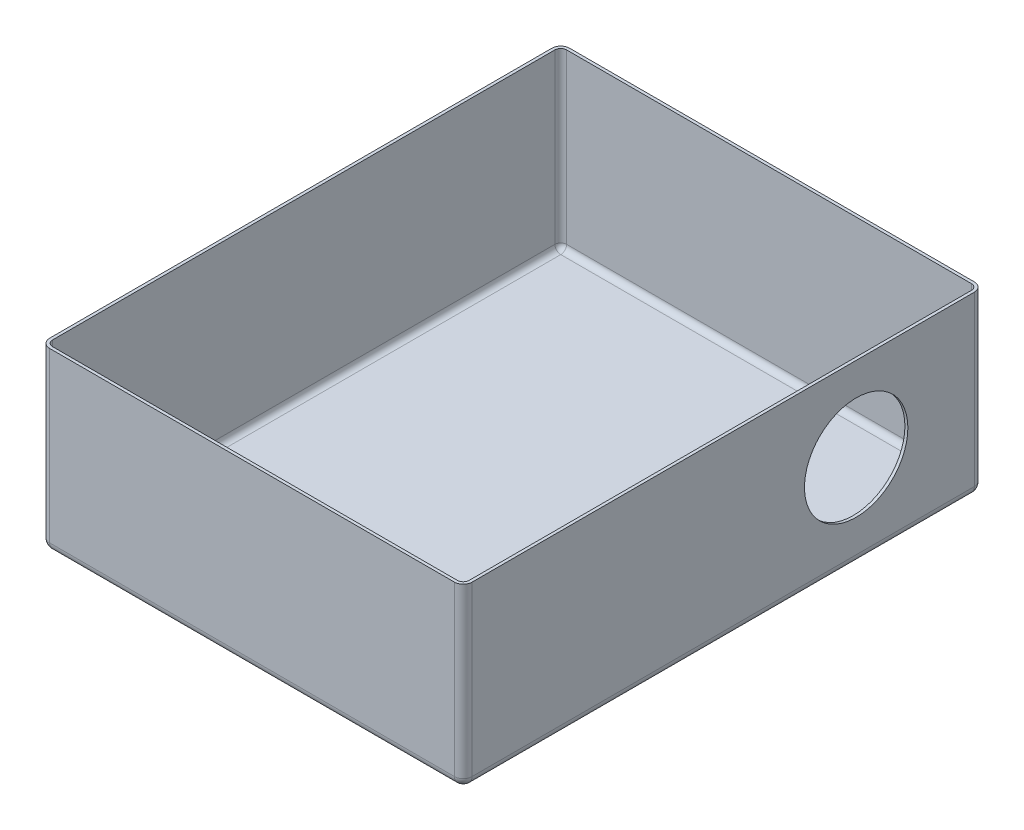
ISO-10303-21;
HEADER;
FILE_DESCRIPTION(('STEP AP214'),'2;1');
FILE_NAME('part.step','',(''),(''),'','','');
FILE_SCHEMA(('AUTOMOTIVE_DESIGN { 1 0 10303 214 1 1 1 1 }'));
ENDSEC;
DATA;
#1=APPLICATION_CONTEXT('core data for automotive mechanical design processes');
#2=APPLICATION_PROTOCOL_DEFINITION('international standard','automotive_design',2000,#1);
#3=PRODUCT_CONTEXT('',#1,'mechanical');
#4=PRODUCT('Part','Part','',(#3));
#5=PRODUCT_RELATED_PRODUCT_CATEGORY('part','',(#4));
#6=PRODUCT_DEFINITION_FORMATION('','',#4);
#7=PRODUCT_DEFINITION_CONTEXT('part definition',#1,'design');
#8=PRODUCT_DEFINITION('design','',#6,#7);
#9=PRODUCT_DEFINITION_SHAPE('','',#8);
#10=(LENGTH_UNIT() NAMED_UNIT(*) SI_UNIT(.MILLI.,.METRE.));
#11=(NAMED_UNIT(*) PLANE_ANGLE_UNIT() SI_UNIT($,.RADIAN.));
#12=(NAMED_UNIT(*) SI_UNIT($,.STERADIAN.) SOLID_ANGLE_UNIT());
#13=UNCERTAINTY_MEASURE_WITH_UNIT(LENGTH_MEASURE(1.E-05),#10,'distance_accuracy_value','');
#14=(GEOMETRIC_REPRESENTATION_CONTEXT(3) GLOBAL_UNCERTAINTY_ASSIGNED_CONTEXT((#13)) GLOBAL_UNIT_ASSIGNED_CONTEXT((#10,
#11,#12)) REPRESENTATION_CONTEXT('',''));
#15=CARTESIAN_POINT('',(0.,0.,0.));
#16=DIRECTION('',(0.,0.,1.));
#17=DIRECTION('',(1.,0.,0.));
#18=AXIS2_PLACEMENT_3D('',#15,#16,#17);
#19=CARTESIAN_POINT('',(71.5,60.,88.));
#20=DIRECTION('',(-1.,0.,0.));
#21=DIRECTION('',(0.,0.,1.));
#22=AXIS2_PLACEMENT_3D('',#19,#20,#21);
#23=PLANE('',#22);
#24=CARTESIAN_POINT('',(71.5,31.5,-45.));
#25=DIRECTION('',(1.,0.,0.));
#26=DIRECTION('',(0.,0.,-1.));
#27=AXIS2_PLACEMENT_3D('',#24,#25,#26);
#28=CIRCLE('',#27,17.5);
#29=CARTESIAN_POINT('',(71.5,31.5,-62.5));
#30=VERTEX_POINT('',#29);
#31=EDGE_CURVE('E849',#30,#30,#28,.T.);
#32=ORIENTED_EDGE('',*,*,#31,.F.);
#33=EDGE_LOOP('',(#32));
#34=FACE_BOUND('',#33,.T.);
#35=DIRECTION('',(0.,-1.,0.));
#36=VECTOR('',#35,1.);
#37=CARTESIAN_POINT('',(71.5,60.,85.));
#38=LINE('',#37,#36);
#39=CARTESIAN_POINT('',(71.5,60.,85.));
#40=VERTEX_POINT('',#39);
#41=CARTESIAN_POINT('',(71.5,3.,85.));
#42=VERTEX_POINT('',#41);
#43=EDGE_CURVE('E310',#40,#42,#38,.T.);
#44=ORIENTED_EDGE('',*,*,#43,.T.);
#45=DIRECTION('',(0.,0.,-1.));
#46=VECTOR('',#45,1.);
#47=CARTESIAN_POINT('',(71.5,3.,-85.));
#48=LINE('',#47,#46);
#49=CARTESIAN_POINT('',(71.5,3.,-85.));
#50=VERTEX_POINT('',#49);
#51=EDGE_CURVE('E325',#42,#50,#48,.T.);
#52=ORIENTED_EDGE('',*,*,#51,.T.);
#53=DIRECTION('',(0.,-1.,0.));
#54=VECTOR('',#53,1.);
#55=CARTESIAN_POINT('',(71.5,60.,-85.));
#56=LINE('',#55,#54);
#57=CARTESIAN_POINT('',(71.5,60.,-85.));
#58=VERTEX_POINT('',#57);
#59=EDGE_CURVE('E307',#50,#58,#56,.F.);
#60=ORIENTED_EDGE('',*,*,#59,.T.);
#61=DIRECTION('',(0.,0.,-1.));
#62=VECTOR('',#61,1.);
#63=CARTESIAN_POINT('',(71.5,60.,88.));
#64=LINE('',#63,#62);
#65=EDGE_CURVE('E265',#40,#58,#64,.T.);
#66=ORIENTED_EDGE('',*,*,#65,.F.);
#67=EDGE_LOOP('',(#44,#52,#60,#66));
#68=FACE_BOUND('',#67,.T.);
#69=ADVANCED_FACE('F40',(#34,#68),#23,.F.);
#70=CARTESIAN_POINT('',(-71.5,60.,-88.));
#71=DIRECTION('',(0.,0.,1.));
#72=DIRECTION('',(1.,0.,0.));
#73=AXIS2_PLACEMENT_3D('',#70,#71,#72);
#74=PLANE('',#73);
#75=DIRECTION('',(0.,-1.,0.));
#76=VECTOR('',#75,1.);
#77=CARTESIAN_POINT('',(68.5,60.,-88.));
#78=LINE('',#77,#76);
#79=CARTESIAN_POINT('',(68.5,60.,-88.));
#80=VERTEX_POINT('',#79);
#81=CARTESIAN_POINT('',(68.5,3.,-88.));
#82=VERTEX_POINT('',#81);
#83=EDGE_CURVE('E317',#80,#82,#78,.T.);
#84=ORIENTED_EDGE('',*,*,#83,.T.);
#85=DIRECTION('',(-1.,0.,0.));
#86=VECTOR('',#85,1.);
#87=CARTESIAN_POINT('',(-68.5,3.,-88.));
#88=LINE('',#87,#86);
#89=CARTESIAN_POINT('',(-68.5,3.,-88.));
#90=VERTEX_POINT('',#89);
#91=EDGE_CURVE('E344',#82,#90,#88,.T.);
#92=ORIENTED_EDGE('',*,*,#91,.T.);
#93=DIRECTION('',(0.,-1.,0.));
#94=VECTOR('',#93,1.);
#95=CARTESIAN_POINT('',(-68.5,60.,-88.));
#96=LINE('',#95,#94);
#97=CARTESIAN_POINT('',(-68.5,60.,-88.));
#98=VERTEX_POINT('',#97);
#99=EDGE_CURVE('E314',#90,#98,#96,.F.);
#100=ORIENTED_EDGE('',*,*,#99,.T.);
#101=DIRECTION('',(-1.,0.,0.));
#102=VECTOR('',#101,1.);
#103=CARTESIAN_POINT('',(-71.5,60.,-88.));
#104=LINE('',#103,#102);
#105=EDGE_CURVE('E269',#80,#98,#104,.T.);
#106=ORIENTED_EDGE('',*,*,#105,.F.);
#107=EDGE_LOOP('',(#84,#92,#100,#106));
#108=FACE_BOUND('',#107,.T.);
#109=ADVANCED_FACE('F441',(#108),#74,.F.);
#110=CARTESIAN_POINT('',(-71.5,60.,88.));
#111=DIRECTION('',(1.,0.,0.));
#112=DIRECTION('',(0.,0.,-1.));
#113=AXIS2_PLACEMENT_3D('',#110,#111,#112);
#114=PLANE('',#113);
#115=DIRECTION('',(0.,-1.,0.));
#116=VECTOR('',#115,1.);
#117=CARTESIAN_POINT('',(-71.5,60.,-85.));
#118=LINE('',#117,#116);
#119=CARTESIAN_POINT('',(-71.5,60.,-85.));
#120=VERTEX_POINT('',#119);
#121=CARTESIAN_POINT('',(-71.5,3.,-85.));
#122=VERTEX_POINT('',#121);
#123=EDGE_CURVE('E288',#120,#122,#118,.T.);
#124=ORIENTED_EDGE('',*,*,#123,.T.);
#125=DIRECTION('',(0.,0.,1.));
#126=VECTOR('',#125,1.);
#127=CARTESIAN_POINT('',(-71.5,3.,85.));
#128=LINE('',#127,#126);
#129=CARTESIAN_POINT('',(-71.5,3.,85.));
#130=VERTEX_POINT('',#129);
#131=EDGE_CURVE('E350',#122,#130,#128,.T.);
#132=ORIENTED_EDGE('',*,*,#131,.T.);
#133=DIRECTION('',(0.,-1.,0.));
#134=VECTOR('',#133,1.);
#135=CARTESIAN_POINT('',(-71.5,60.,85.));
#136=LINE('',#135,#134);
#137=CARTESIAN_POINT('',(-71.5,60.,85.));
#138=VERTEX_POINT('',#137);
#139=EDGE_CURVE('E292',#130,#138,#136,.F.);
#140=ORIENTED_EDGE('',*,*,#139,.T.);
#141=DIRECTION('',(0.,0.,1.));
#142=VECTOR('',#141,1.);
#143=CARTESIAN_POINT('',(-71.5,60.,88.));
#144=LINE('',#143,#142);
#145=EDGE_CURVE('E274',#120,#138,#144,.T.);
#146=ORIENTED_EDGE('',*,*,#145,.F.);
#147=EDGE_LOOP('',(#124,#132,#140,#146));
#148=FACE_BOUND('',#147,.T.);
#149=ADVANCED_FACE('F400',(#148),#114,.F.);
#150=CARTESIAN_POINT('',(-71.5,60.,88.));
#151=DIRECTION('',(0.,0.,-1.));
#152=DIRECTION('',(-1.,0.,0.));
#153=AXIS2_PLACEMENT_3D('',#150,#151,#152);
#154=PLANE('',#153);
#155=DIRECTION('',(0.,-1.,0.));
#156=VECTOR('',#155,1.);
#157=CARTESIAN_POINT('',(-68.5,60.,88.));
#158=LINE('',#157,#156);
#159=CARTESIAN_POINT('',(-68.5,60.,88.));
#160=VERTEX_POINT('',#159);
#161=CARTESIAN_POINT('',(-68.5,3.,88.));
#162=VERTEX_POINT('',#161);
#163=EDGE_CURVE('E285',#160,#162,#158,.T.);
#164=ORIENTED_EDGE('',*,*,#163,.T.);
#165=DIRECTION('',(1.,0.,0.));
#166=VECTOR('',#165,1.);
#167=CARTESIAN_POINT('',(68.5,3.,88.));
#168=LINE('',#167,#166);
#169=CARTESIAN_POINT('',(68.5,3.,88.));
#170=VERTEX_POINT('',#169);
#171=EDGE_CURVE('E11',#162,#170,#168,.T.);
#172=ORIENTED_EDGE('',*,*,#171,.T.);
#173=DIRECTION('',(0.,-1.,0.));
#174=VECTOR('',#173,1.);
#175=CARTESIAN_POINT('',(68.5,60.,88.));
#176=LINE('',#175,#174);
#177=CARTESIAN_POINT('',(68.5,60.,88.));
#178=VERTEX_POINT('',#177);
#179=EDGE_CURVE('E282',#170,#178,#176,.F.);
#180=ORIENTED_EDGE('',*,*,#179,.T.);
#181=DIRECTION('',(1.,0.,0.));
#182=VECTOR('',#181,1.);
#183=CARTESIAN_POINT('',(-71.5,60.,88.));
#184=LINE('',#183,#182);
#185=EDGE_CURVE('E278',#160,#178,#184,.T.);
#186=ORIENTED_EDGE('',*,*,#185,.F.);
#187=EDGE_LOOP('',(#164,#172,#180,#186));
#188=FACE_BOUND('',#187,.T.);
#189=ADVANCED_FACE('F409',(#188),#154,.F.);
#190=CARTESIAN_POINT('',(0.,60.,0.));
#191=DIRECTION('',(0.,-1.,0.));
#192=DIRECTION('',(0.,0.,-1.));
#193=AXIS2_PLACEMENT_3D('',#190,#191,#192);
#194=PLANE('',#193);
#195=DIRECTION('',(0.,0.,1.));
#196=VECTOR('',#195,1.);
#197=CARTESIAN_POINT('',(-70.5,60.,0.));
#198=LINE('',#197,#196);
#199=CARTESIAN_POINT('',(-70.5,60.,-85.));
#200=VERTEX_POINT('',#199);
#201=CARTESIAN_POINT('',(-70.5,60.,85.));
#202=VERTEX_POINT('',#201);
#203=EDGE_CURVE('E249',#200,#202,#198,.T.);
#204=ORIENTED_EDGE('',*,*,#203,.F.);
#205=CARTESIAN_POINT('',(-68.5,60.,-85.));
#206=DIRECTION('',(0.,-1.,0.));
#207=DIRECTION('',(0.,0.,-1.));
#208=AXIS2_PLACEMENT_3D('',#205,#206,#207);
#209=CIRCLE('',#208,2.);
#210=CARTESIAN_POINT('',(-68.5,60.,-87.));
#211=VERTEX_POINT('',#210);
#212=EDGE_CURVE('E246',#211,#200,#209,.F.);
#213=ORIENTED_EDGE('',*,*,#212,.F.);
#214=DIRECTION('',(-1.,0.,0.));
#215=VECTOR('',#214,1.);
#216=CARTESIAN_POINT('',(0.,60.,-87.));
#217=LINE('',#216,#215);
#218=CARTESIAN_POINT('',(68.5,60.,-87.));
#219=VERTEX_POINT('',#218);
#220=EDGE_CURVE('E58',#219,#211,#217,.T.);
#221=ORIENTED_EDGE('',*,*,#220,.F.);
#222=CARTESIAN_POINT('',(68.5,60.,-85.));
#223=DIRECTION('',(0.,-1.,0.));
#224=DIRECTION('',(0.,0.,-1.));
#225=AXIS2_PLACEMENT_3D('',#222,#223,#224);
#226=CIRCLE('',#225,2.);
#227=CARTESIAN_POINT('',(70.5,60.,-85.));
#228=VERTEX_POINT('',#227);
#229=EDGE_CURVE('E242',#228,#219,#226,.F.);
#230=ORIENTED_EDGE('',*,*,#229,.F.);
#231=DIRECTION('',(0.,0.,-1.));
#232=VECTOR('',#231,1.);
#233=CARTESIAN_POINT('',(70.5,60.,0.));
#234=LINE('',#233,#232);
#235=CARTESIAN_POINT('',(70.5,60.,85.));
#236=VERTEX_POINT('',#235);
#237=EDGE_CURVE('E203',#236,#228,#234,.T.);
#238=ORIENTED_EDGE('',*,*,#237,.F.);
#239=CARTESIAN_POINT('',(68.5,60.,85.));
#240=DIRECTION('',(0.,-1.,0.));
#241=DIRECTION('',(0.,0.,-1.));
#242=AXIS2_PLACEMENT_3D('',#239,#240,#241);
#243=CIRCLE('',#242,2.);
#244=CARTESIAN_POINT('',(68.5,60.,87.));
#245=VERTEX_POINT('',#244);
#246=EDGE_CURVE('E245',#245,#236,#243,.F.);
#247=ORIENTED_EDGE('',*,*,#246,.F.);
#248=DIRECTION('',(1.,0.,0.));
#249=VECTOR('',#248,1.);
#250=CARTESIAN_POINT('',(0.,60.,87.));
#251=LINE('',#250,#249);
#252=CARTESIAN_POINT('',(-68.5,60.,87.));
#253=VERTEX_POINT('',#252);
#254=EDGE_CURVE('E256',#253,#245,#251,.T.);
#255=ORIENTED_EDGE('',*,*,#254,.F.);
#256=CARTESIAN_POINT('',(-68.5,60.,85.));
#257=DIRECTION('',(0.,-1.,0.));
#258=DIRECTION('',(0.,0.,-1.));
#259=AXIS2_PLACEMENT_3D('',#256,#257,#258);
#260=CIRCLE('',#259,2.);
#261=EDGE_CURVE('E208',#202,#253,#260,.F.);
#262=ORIENTED_EDGE('',*,*,#261,.F.);
#263=EDGE_LOOP('',(#204,#213,#221,#230,#238,#247,#255,#262));
#264=FACE_BOUND('',#263,.T.);
#265=ORIENTED_EDGE('',*,*,#145,.T.);
#266=CARTESIAN_POINT('',(-68.5,60.,85.));
#267=DIRECTION('',(0.,-1.,0.));
#268=DIRECTION('',(0.,0.,-1.));
#269=AXIS2_PLACEMENT_3D('',#266,#267,#268);
#270=CIRCLE('',#269,3.);
#271=EDGE_CURVE('E304',#138,#160,#270,.F.);
#272=ORIENTED_EDGE('',*,*,#271,.T.);
#273=ORIENTED_EDGE('',*,*,#185,.T.);
#274=CARTESIAN_POINT('',(68.5,60.,85.));
#275=DIRECTION('',(0.,-1.,0.));
#276=DIRECTION('',(0.,0.,-1.));
#277=AXIS2_PLACEMENT_3D('',#274,#275,#276);
#278=CIRCLE('',#277,3.);
#279=EDGE_CURVE('E301',#178,#40,#278,.F.);
#280=ORIENTED_EDGE('',*,*,#279,.T.);
#281=ORIENTED_EDGE('',*,*,#65,.T.);
#282=CARTESIAN_POINT('',(68.5,60.,-85.));
#283=DIRECTION('',(0.,-1.,0.));
#284=DIRECTION('',(0.,0.,-1.));
#285=AXIS2_PLACEMENT_3D('',#282,#283,#284);
#286=CIRCLE('',#285,3.);
#287=EDGE_CURVE('E298',#58,#80,#286,.F.);
#288=ORIENTED_EDGE('',*,*,#287,.T.);
#289=ORIENTED_EDGE('',*,*,#105,.T.);
#290=CARTESIAN_POINT('',(-68.5,60.,-85.));
#291=DIRECTION('',(0.,-1.,0.));
#292=DIRECTION('',(0.,0.,-1.));
#293=AXIS2_PLACEMENT_3D('',#290,#291,#292);
#294=CIRCLE('',#293,3.);
#295=EDGE_CURVE('E295',#98,#120,#294,.F.);
#296=ORIENTED_EDGE('',*,*,#295,.T.);
#297=EDGE_LOOP('',(#265,#272,#273,#280,#281,#288,#289,#296));
#298=FACE_BOUND('',#297,.T.);
#299=ADVANCED_FACE('F403',(#264,#298),#194,.F.);
#300=CARTESIAN_POINT('',(0.,0.,0.));
#301=DIRECTION('',(0.,-1.,0.));
#302=DIRECTION('',(0.,0.,-1.));
#303=AXIS2_PLACEMENT_3D('',#300,#301,#302);
#304=PLANE('',#303);
#305=DIRECTION('',(-1.,0.,0.));
#306=VECTOR('',#305,1.);
#307=CARTESIAN_POINT('',(68.5,0.,-85.));
#308=LINE('',#307,#306);
#309=CARTESIAN_POINT('',(-68.5,0.,-85.));
#310=VERTEX_POINT('',#309);
#311=CARTESIAN_POINT('',(68.5,0.,-85.));
#312=VERTEX_POINT('',#311);
#313=EDGE_CURVE('E334',#310,#312,#308,.F.);
#314=ORIENTED_EDGE('',*,*,#313,.T.);
#315=DIRECTION('',(0.,0.,-1.));
#316=VECTOR('',#315,1.);
#317=CARTESIAN_POINT('',(68.5,0.,85.));
#318=LINE('',#317,#316);
#319=CARTESIAN_POINT('',(68.5,0.,85.));
#320=VERTEX_POINT('',#319);
#321=EDGE_CURVE('E337',#312,#320,#318,.F.);
#322=ORIENTED_EDGE('',*,*,#321,.T.);
#323=DIRECTION('',(1.,0.,0.));
#324=VECTOR('',#323,1.);
#325=CARTESIAN_POINT('',(-68.5,0.,85.));
#326=LINE('',#325,#324);
#327=CARTESIAN_POINT('',(-68.5,0.,85.));
#328=VERTEX_POINT('',#327);
#329=EDGE_CURVE('E328',#320,#328,#326,.F.);
#330=ORIENTED_EDGE('',*,*,#329,.T.);
#331=DIRECTION('',(0.,0.,1.));
#332=VECTOR('',#331,1.);
#333=CARTESIAN_POINT('',(-68.5,0.,-85.));
#334=LINE('',#333,#332);
#335=EDGE_CURVE('E331',#328,#310,#334,.F.);
#336=ORIENTED_EDGE('',*,*,#335,.T.);
#337=EDGE_LOOP('',(#314,#322,#330,#336));
#338=FACE_BOUND('',#337,.T.);
#339=ADVANCED_FACE('F456',(#338),#304,.T.);
#340=CARTESIAN_POINT('',(-68.5,60.,85.));
#341=DIRECTION('',(0.,-1.,0.));
#342=DIRECTION('',(0.,0.,-1.));
#343=AXIS2_PLACEMENT_3D('',#340,#341,#342);
#344=CYLINDRICAL_SURFACE('',#343,3.);
#345=ORIENTED_EDGE('',*,*,#139,.F.);
#346=CARTESIAN_POINT('',(-68.5,3.,85.));
#347=DIRECTION('',(0.,-1.,0.));
#348=DIRECTION('',(0.,0.,-1.));
#349=AXIS2_PLACEMENT_3D('',#346,#347,#348);
#350=CIRCLE('',#349,3.);
#351=EDGE_CURVE('E50',#130,#162,#350,.F.);
#352=ORIENTED_EDGE('',*,*,#351,.T.);
#353=ORIENTED_EDGE('',*,*,#163,.F.);
#354=ORIENTED_EDGE('',*,*,#271,.F.);
#355=EDGE_LOOP('',(#345,#352,#353,#354));
#356=FACE_BOUND('',#355,.T.);
#357=ADVANCED_FACE('F405',(#356),#344,.T.);
#358=CARTESIAN_POINT('',(68.5,60.,85.));
#359=DIRECTION('',(0.,-1.,0.));
#360=DIRECTION('',(0.,0.,-1.));
#361=AXIS2_PLACEMENT_3D('',#358,#359,#360);
#362=CYLINDRICAL_SURFACE('',#361,3.);
#363=ORIENTED_EDGE('',*,*,#179,.F.);
#364=CARTESIAN_POINT('',(68.5,3.,85.));
#365=DIRECTION('',(0.,-1.,0.));
#366=DIRECTION('',(0.,0.,-1.));
#367=AXIS2_PLACEMENT_3D('',#364,#365,#366);
#368=CIRCLE('',#367,3.);
#369=EDGE_CURVE('E321',#170,#42,#368,.F.);
#370=ORIENTED_EDGE('',*,*,#369,.T.);
#371=ORIENTED_EDGE('',*,*,#43,.F.);
#372=ORIENTED_EDGE('',*,*,#279,.F.);
#373=EDGE_LOOP('',(#363,#370,#371,#372));
#374=FACE_BOUND('',#373,.T.);
#375=ADVANCED_FACE('F431',(#374),#362,.T.);
#376=CARTESIAN_POINT('',(68.5,60.,-85.));
#377=DIRECTION('',(0.,-1.,0.));
#378=DIRECTION('',(0.,0.,-1.));
#379=AXIS2_PLACEMENT_3D('',#376,#377,#378);
#380=CYLINDRICAL_SURFACE('',#379,3.);
#381=ORIENTED_EDGE('',*,*,#59,.F.);
#382=CARTESIAN_POINT('',(68.5,3.,-85.));
#383=DIRECTION('',(0.,-1.,0.));
#384=DIRECTION('',(0.,0.,-1.));
#385=AXIS2_PLACEMENT_3D('',#382,#383,#384);
#386=CIRCLE('',#385,3.);
#387=EDGE_CURVE('E341',#50,#82,#386,.F.);
#388=ORIENTED_EDGE('',*,*,#387,.T.);
#389=ORIENTED_EDGE('',*,*,#83,.F.);
#390=ORIENTED_EDGE('',*,*,#287,.F.);
#391=EDGE_LOOP('',(#381,#388,#389,#390));
#392=FACE_BOUND('',#391,.T.);
#393=ADVANCED_FACE('F438',(#392),#380,.T.);
#394=CARTESIAN_POINT('',(-68.5,60.,-85.));
#395=DIRECTION('',(0.,-1.,0.));
#396=DIRECTION('',(0.,0.,-1.));
#397=AXIS2_PLACEMENT_3D('',#394,#395,#396);
#398=CYLINDRICAL_SURFACE('',#397,3.);
#399=ORIENTED_EDGE('',*,*,#99,.F.);
#400=CARTESIAN_POINT('',(-68.5,3.,-85.));
#401=DIRECTION('',(0.,-1.,0.));
#402=DIRECTION('',(0.,0.,-1.));
#403=AXIS2_PLACEMENT_3D('',#400,#401,#402);
#404=CIRCLE('',#403,3.);
#405=EDGE_CURVE('E347',#90,#122,#404,.F.);
#406=ORIENTED_EDGE('',*,*,#405,.T.);
#407=ORIENTED_EDGE('',*,*,#123,.F.);
#408=ORIENTED_EDGE('',*,*,#295,.F.);
#409=EDGE_LOOP('',(#399,#406,#407,#408));
#410=FACE_BOUND('',#409,.T.);
#411=ADVANCED_FACE('F396',(#410),#398,.T.);
#412=CARTESIAN_POINT('',(-68.5,3.,-85.));
#413=DIRECTION('',(0.,-1.,0.));
#414=DIRECTION('',(0.,0.,-1.));
#415=AXIS2_PLACEMENT_3D('',#412,#413,#414);
#416=SPHERICAL_SURFACE('',#415,3.);
#417=CARTESIAN_POINT('',(-68.5,3.,-85.));
#418=DIRECTION('',(0.,0.,1.));
#419=DIRECTION('',(1.,0.,0.));
#420=AXIS2_PLACEMENT_3D('',#417,#418,#419);
#421=CIRCLE('',#420,3.);
#422=EDGE_CURVE('E378',#122,#310,#421,.T.);
#423=ORIENTED_EDGE('',*,*,#422,.F.);
#424=ORIENTED_EDGE('',*,*,#405,.F.);
#425=CARTESIAN_POINT('',(-68.5,3.,-85.));
#426=DIRECTION('',(1.,0.,0.));
#427=DIRECTION('',(0.,0.,-1.));
#428=AXIS2_PLACEMENT_3D('',#425,#426,#427);
#429=CIRCLE('',#428,3.);
#430=EDGE_CURVE('E270',#310,#90,#429,.T.);
#431=ORIENTED_EDGE('',*,*,#430,.F.);
#432=EDGE_LOOP('',(#423,#424,#431));
#433=FACE_BOUND('',#432,.T.);
#434=ADVANCED_FACE('F42',(#433),#416,.T.);
#435=CARTESIAN_POINT('',(-71.5,3.,-85.));
#436=DIRECTION('',(1.,0.,0.));
#437=DIRECTION('',(0.,0.,-1.));
#438=AXIS2_PLACEMENT_3D('',#435,#436,#437);
#439=CYLINDRICAL_SURFACE('',#438,3.);
#440=ORIENTED_EDGE('',*,*,#430,.T.);
#441=ORIENTED_EDGE('',*,*,#91,.F.);
#442=CARTESIAN_POINT('',(68.5,3.,-85.));
#443=DIRECTION('',(1.,0.,0.));
#444=DIRECTION('',(0.,0.,-1.));
#445=AXIS2_PLACEMENT_3D('',#442,#443,#444);
#446=CIRCLE('',#445,3.);
#447=EDGE_CURVE('E374',#312,#82,#446,.T.);
#448=ORIENTED_EDGE('',*,*,#447,.F.);
#449=ORIENTED_EDGE('',*,*,#313,.F.);
#450=EDGE_LOOP('',(#440,#441,#448,#449));
#451=FACE_BOUND('',#450,.T.);
#452=ADVANCED_FACE('F387',(#451),#439,.T.);
#453=CARTESIAN_POINT('',(-68.5,3.,88.));
#454=DIRECTION('',(0.,0.,-1.));
#455=DIRECTION('',(-1.,0.,0.));
#456=AXIS2_PLACEMENT_3D('',#453,#454,#455);
#457=CYLINDRICAL_SURFACE('',#456,3.);
#458=ORIENTED_EDGE('',*,*,#422,.T.);
#459=ORIENTED_EDGE('',*,*,#335,.F.);
#460=CARTESIAN_POINT('',(-68.5,3.,85.));
#461=DIRECTION('',(0.,0.,1.));
#462=DIRECTION('',(1.,0.,0.));
#463=AXIS2_PLACEMENT_3D('',#460,#461,#462);
#464=CIRCLE('',#463,3.);
#465=EDGE_CURVE('E370',#130,#328,#464,.T.);
#466=ORIENTED_EDGE('',*,*,#465,.F.);
#467=ORIENTED_EDGE('',*,*,#131,.F.);
#468=EDGE_LOOP('',(#458,#459,#466,#467));
#469=FACE_BOUND('',#468,.T.);
#470=ADVANCED_FACE('F474',(#469),#457,.T.);
#471=CARTESIAN_POINT('',(68.5,3.,-85.));
#472=DIRECTION('',(0.,-1.,0.));
#473=DIRECTION('',(0.,0.,-1.));
#474=AXIS2_PLACEMENT_3D('',#471,#472,#473);
#475=SPHERICAL_SURFACE('',#474,3.);
#476=ORIENTED_EDGE('',*,*,#447,.T.);
#477=ORIENTED_EDGE('',*,*,#387,.F.);
#478=CARTESIAN_POINT('',(68.5,3.,-85.));
#479=DIRECTION('',(0.,0.,1.));
#480=DIRECTION('',(1.,0.,0.));
#481=AXIS2_PLACEMENT_3D('',#478,#479,#480);
#482=CIRCLE('',#481,3.);
#483=EDGE_CURVE('E366',#312,#50,#482,.T.);
#484=ORIENTED_EDGE('',*,*,#483,.F.);
#485=EDGE_LOOP('',(#476,#477,#484));
#486=FACE_BOUND('',#485,.T.);
#487=ADVANCED_FACE('F471',(#486),#475,.T.);
#488=CARTESIAN_POINT('',(-68.5,3.,85.));
#489=DIRECTION('',(0.,-1.,0.));
#490=DIRECTION('',(0.,0.,-1.));
#491=AXIS2_PLACEMENT_3D('',#488,#489,#490);
#492=SPHERICAL_SURFACE('',#491,3.);
#493=ORIENTED_EDGE('',*,*,#351,.F.);
#494=ORIENTED_EDGE('',*,*,#465,.T.);
#495=CARTESIAN_POINT('',(-68.5,3.,85.));
#496=DIRECTION('',(1.,0.,0.));
#497=DIRECTION('',(0.,0.,-1.));
#498=AXIS2_PLACEMENT_3D('',#495,#496,#497);
#499=CIRCLE('',#498,3.);
#500=EDGE_CURVE('E362',#162,#328,#499,.T.);
#501=ORIENTED_EDGE('',*,*,#500,.F.);
#502=EDGE_LOOP('',(#493,#494,#501));
#503=FACE_BOUND('',#502,.T.);
#504=ADVANCED_FACE('F413',(#503),#492,.T.);
#505=CARTESIAN_POINT('',(68.5,3.,88.));
#506=DIRECTION('',(0.,0.,1.));
#507=DIRECTION('',(1.,0.,0.));
#508=AXIS2_PLACEMENT_3D('',#505,#506,#507);
#509=CYLINDRICAL_SURFACE('',#508,3.);
#510=ORIENTED_EDGE('',*,*,#483,.T.);
#511=ORIENTED_EDGE('',*,*,#51,.F.);
#512=CARTESIAN_POINT('',(68.5,3.,85.));
#513=DIRECTION('',(0.,0.,1.));
#514=DIRECTION('',(1.,0.,0.));
#515=AXIS2_PLACEMENT_3D('',#512,#513,#514);
#516=CIRCLE('',#515,3.);
#517=EDGE_CURVE('E358',#320,#42,#516,.T.);
#518=ORIENTED_EDGE('',*,*,#517,.F.);
#519=ORIENTED_EDGE('',*,*,#321,.F.);
#520=EDGE_LOOP('',(#510,#511,#518,#519));
#521=FACE_BOUND('',#520,.T.);
#522=ADVANCED_FACE('F425',(#521),#509,.T.);
#523=CARTESIAN_POINT('',(-71.5,3.,85.));
#524=DIRECTION('',(-1.,0.,0.));
#525=DIRECTION('',(0.,0.,1.));
#526=AXIS2_PLACEMENT_3D('',#523,#524,#525);
#527=CYLINDRICAL_SURFACE('',#526,3.);
#528=ORIENTED_EDGE('',*,*,#500,.T.);
#529=ORIENTED_EDGE('',*,*,#329,.F.);
#530=CARTESIAN_POINT('',(68.5,3.,85.));
#531=DIRECTION('',(1.,0.,0.));
#532=DIRECTION('',(0.,0.,-1.));
#533=AXIS2_PLACEMENT_3D('',#530,#531,#532);
#534=CIRCLE('',#533,3.);
#535=EDGE_CURVE('E355',#170,#320,#534,.T.);
#536=ORIENTED_EDGE('',*,*,#535,.F.);
#537=ORIENTED_EDGE('',*,*,#171,.F.);
#538=EDGE_LOOP('',(#528,#529,#536,#537));
#539=FACE_BOUND('',#538,.T.);
#540=ADVANCED_FACE('F417',(#539),#527,.T.);
#541=CARTESIAN_POINT('',(68.5,3.,85.));
#542=DIRECTION('',(0.,-1.,0.));
#543=DIRECTION('',(0.,0.,-1.));
#544=AXIS2_PLACEMENT_3D('',#541,#542,#543);
#545=SPHERICAL_SURFACE('',#544,3.);
#546=ORIENTED_EDGE('',*,*,#517,.T.);
#547=ORIENTED_EDGE('',*,*,#369,.F.);
#548=ORIENTED_EDGE('',*,*,#535,.T.);
#549=EDGE_LOOP('',(#546,#547,#548));
#550=FACE_BOUND('',#549,.T.);
#551=ADVANCED_FACE('F421',(#550),#545,.T.);
#552=CARTESIAN_POINT('',(70.5,60.,88.));
#553=DIRECTION('',(-1.,0.,0.));
#554=DIRECTION('',(0.,0.,1.));
#555=AXIS2_PLACEMENT_3D('',#552,#553,#554);
#556=PLANE('',#555);
#557=CARTESIAN_POINT('',(70.5,31.5,-45.));
#558=DIRECTION('',(-1.,0.,0.));
#559=DIRECTION('',(0.,0.,1.));
#560=AXIS2_PLACEMENT_3D('',#557,#558,#559);
#561=CIRCLE('',#560,17.5);
#562=CARTESIAN_POINT('',(70.5,31.5,-27.5));
#563=VERTEX_POINT('',#562);
#564=EDGE_CURVE('E44',#563,#563,#561,.T.);
#565=ORIENTED_EDGE('',*,*,#564,.F.);
#566=EDGE_LOOP('',(#565));
#567=FACE_BOUND('',#566,.T.);
#568=DIRECTION('',(0.,1.,0.));
#569=VECTOR('',#568,1.);
#570=CARTESIAN_POINT('',(70.5,60.,85.));
#571=LINE('',#570,#569);
#572=CARTESIAN_POINT('',(70.5,3.,85.));
#573=VERTEX_POINT('',#572);
#574=EDGE_CURVE('E207',#236,#573,#571,.F.);
#575=ORIENTED_EDGE('',*,*,#574,.F.);
#576=ORIENTED_EDGE('',*,*,#237,.T.);
#577=DIRECTION('',(0.,1.,0.));
#578=VECTOR('',#577,1.);
#579=CARTESIAN_POINT('',(70.5,60.,-85.));
#580=LINE('',#579,#578);
#581=CARTESIAN_POINT('',(70.5,3.,-85.));
#582=VERTEX_POINT('',#581);
#583=EDGE_CURVE('E199',#582,#228,#580,.T.);
#584=ORIENTED_EDGE('',*,*,#583,.F.);
#585=DIRECTION('',(0.,0.,1.));
#586=VECTOR('',#585,1.);
#587=CARTESIAN_POINT('',(70.5,3.,88.));
#588=LINE('',#587,#586);
#589=EDGE_CURVE('E182',#573,#582,#588,.F.);
#590=ORIENTED_EDGE('',*,*,#589,.F.);
#591=EDGE_LOOP('',(#575,#576,#584,#590));
#592=FACE_BOUND('',#591,.T.);
#593=ADVANCED_FACE('F201',(#567,#592),#556,.T.);
#594=CARTESIAN_POINT('',(-71.5,60.,-87.));
#595=DIRECTION('',(0.,0.,1.));
#596=DIRECTION('',(1.,0.,0.));
#597=AXIS2_PLACEMENT_3D('',#594,#595,#596);
#598=PLANE('',#597);
#599=DIRECTION('',(0.,1.,0.));
#600=VECTOR('',#599,1.);
#601=CARTESIAN_POINT('',(68.5,60.,-87.));
#602=LINE('',#601,#600);
#603=CARTESIAN_POINT('',(68.5,3.,-87.));
#604=VERTEX_POINT('',#603);
#605=EDGE_CURVE('E213',#219,#604,#602,.F.);
#606=ORIENTED_EDGE('',*,*,#605,.F.);
#607=ORIENTED_EDGE('',*,*,#220,.T.);
#608=DIRECTION('',(0.,1.,0.));
#609=VECTOR('',#608,1.);
#610=CARTESIAN_POINT('',(-68.5,60.,-87.));
#611=LINE('',#610,#609);
#612=CARTESIAN_POINT('',(-68.5,3.,-87.));
#613=VERTEX_POINT('',#612);
#614=EDGE_CURVE('E781',#613,#211,#611,.T.);
#615=ORIENTED_EDGE('',*,*,#614,.F.);
#616=DIRECTION('',(1.,0.,0.));
#617=VECTOR('',#616,1.);
#618=CARTESIAN_POINT('',(-71.5,3.,-87.));
#619=LINE('',#618,#617);
#620=EDGE_CURVE('E218',#604,#613,#619,.F.);
#621=ORIENTED_EDGE('',*,*,#620,.F.);
#622=EDGE_LOOP('',(#606,#607,#615,#621));
#623=FACE_BOUND('',#622,.T.);
#624=ADVANCED_FACE('F548',(#623),#598,.T.);
#625=CARTESIAN_POINT('',(-70.5,60.,88.));
#626=DIRECTION('',(1.,0.,0.));
#627=DIRECTION('',(0.,0.,-1.));
#628=AXIS2_PLACEMENT_3D('',#625,#626,#627);
#629=PLANE('',#628);
#630=DIRECTION('',(0.,1.,0.));
#631=VECTOR('',#630,1.);
#632=CARTESIAN_POINT('',(-70.5,60.,-85.));
#633=LINE('',#632,#631);
#634=CARTESIAN_POINT('',(-70.5,3.,-85.));
#635=VERTEX_POINT('',#634);
#636=EDGE_CURVE('E789',#200,#635,#633,.F.);
#637=ORIENTED_EDGE('',*,*,#636,.F.);
#638=ORIENTED_EDGE('',*,*,#203,.T.);
#639=DIRECTION('',(0.,1.,0.));
#640=VECTOR('',#639,1.);
#641=CARTESIAN_POINT('',(-70.5,60.,85.));
#642=LINE('',#641,#640);
#643=CARTESIAN_POINT('',(-70.5,3.,85.));
#644=VERTEX_POINT('',#643);
#645=EDGE_CURVE('E252',#644,#202,#642,.T.);
#646=ORIENTED_EDGE('',*,*,#645,.F.);
#647=DIRECTION('',(0.,0.,-1.));
#648=VECTOR('',#647,1.);
#649=CARTESIAN_POINT('',(-70.5,3.,88.));
#650=LINE('',#649,#648);
#651=EDGE_CURVE('E793',#635,#644,#650,.F.);
#652=ORIENTED_EDGE('',*,*,#651,.F.);
#653=EDGE_LOOP('',(#637,#638,#646,#652));
#654=FACE_BOUND('',#653,.T.);
#655=ADVANCED_FACE('F660',(#654),#629,.T.);
#656=CARTESIAN_POINT('',(-71.5,60.,87.));
#657=DIRECTION('',(0.,0.,-1.));
#658=DIRECTION('',(-1.,0.,0.));
#659=AXIS2_PLACEMENT_3D('',#656,#657,#658);
#660=PLANE('',#659);
#661=DIRECTION('',(0.,1.,0.));
#662=VECTOR('',#661,1.);
#663=CARTESIAN_POINT('',(-68.5,60.,87.));
#664=LINE('',#663,#662);
#665=CARTESIAN_POINT('',(-68.5,3.,87.));
#666=VERTEX_POINT('',#665);
#667=EDGE_CURVE('E795',#253,#666,#664,.F.);
#668=ORIENTED_EDGE('',*,*,#667,.F.);
#669=ORIENTED_EDGE('',*,*,#254,.T.);
#670=DIRECTION('',(0.,1.,0.));
#671=VECTOR('',#670,1.);
#672=CARTESIAN_POINT('',(68.5,60.,87.));
#673=LINE('',#672,#671);
#674=CARTESIAN_POINT('',(68.5,3.,87.));
#675=VERTEX_POINT('',#674);
#676=EDGE_CURVE('E262',#675,#245,#673,.T.);
#677=ORIENTED_EDGE('',*,*,#676,.F.);
#678=DIRECTION('',(-1.,0.,0.));
#679=VECTOR('',#678,1.);
#680=CARTESIAN_POINT('',(-71.5,3.,87.));
#681=LINE('',#680,#679);
#682=EDGE_CURVE('E359',#666,#675,#681,.F.);
#683=ORIENTED_EDGE('',*,*,#682,.F.);
#684=EDGE_LOOP('',(#668,#669,#677,#683));
#685=FACE_BOUND('',#684,.T.);
#686=ADVANCED_FACE('F652',(#685),#660,.T.);
#687=CARTESIAN_POINT('',(0.,1.,0.));
#688=DIRECTION('',(0.,-1.,0.));
#689=DIRECTION('',(0.,0.,-1.));
#690=AXIS2_PLACEMENT_3D('',#687,#688,#689);
#691=PLANE('',#690);
#692=DIRECTION('',(1.,0.,0.));
#693=VECTOR('',#692,1.);
#694=CARTESIAN_POINT('',(0.,1.,-85.));
#695=LINE('',#694,#693);
#696=CARTESIAN_POINT('',(-68.5,1.,-85.));
#697=VERTEX_POINT('',#696);
#698=CARTESIAN_POINT('',(68.5,1.,-85.));
#699=VERTEX_POINT('',#698);
#700=EDGE_CURVE('E820',#697,#699,#695,.T.);
#701=ORIENTED_EDGE('',*,*,#700,.F.);
#702=DIRECTION('',(0.,0.,-1.));
#703=VECTOR('',#702,1.);
#704=CARTESIAN_POINT('',(-68.5,1.,0.));
#705=LINE('',#704,#703);
#706=CARTESIAN_POINT('',(-68.5,1.,85.));
#707=VERTEX_POINT('',#706);
#708=EDGE_CURVE('E823',#707,#697,#705,.T.);
#709=ORIENTED_EDGE('',*,*,#708,.F.);
#710=DIRECTION('',(1.,0.,0.));
#711=VECTOR('',#710,1.);
#712=CARTESIAN_POINT('',(0.,1.,85.));
#713=LINE('',#712,#711);
#714=CARTESIAN_POINT('',(68.5,1.,85.));
#715=VERTEX_POINT('',#714);
#716=EDGE_CURVE('E195',#715,#707,#713,.F.);
#717=ORIENTED_EDGE('',*,*,#716,.F.);
#718=DIRECTION('',(0.,0.,-1.));
#719=VECTOR('',#718,1.);
#720=CARTESIAN_POINT('',(68.5,1.,0.));
#721=LINE('',#720,#719);
#722=EDGE_CURVE('E219',#699,#715,#721,.F.);
#723=ORIENTED_EDGE('',*,*,#722,.F.);
#724=EDGE_LOOP('',(#701,#709,#717,#723));
#725=FACE_BOUND('',#724,.T.);
#726=ADVANCED_FACE('F644',(#725),#691,.F.);
#727=CARTESIAN_POINT('',(-68.5,60.,85.));
#728=DIRECTION('',(0.,-1.,0.));
#729=DIRECTION('',(0.,0.,-1.));
#730=AXIS2_PLACEMENT_3D('',#727,#728,#729);
#731=CYLINDRICAL_SURFACE('',#730,2.);
#732=ORIENTED_EDGE('',*,*,#645,.T.);
#733=ORIENTED_EDGE('',*,*,#261,.T.);
#734=ORIENTED_EDGE('',*,*,#667,.T.);
#735=CARTESIAN_POINT('',(-68.5,3.,85.));
#736=DIRECTION('',(0.,-1.,0.));
#737=DIRECTION('',(0.,0.,-1.));
#738=AXIS2_PLACEMENT_3D('',#735,#736,#737);
#739=CIRCLE('',#738,2.);
#740=EDGE_CURVE('E804',#644,#666,#739,.F.);
#741=ORIENTED_EDGE('',*,*,#740,.F.);
#742=EDGE_LOOP('',(#732,#733,#734,#741));
#743=FACE_BOUND('',#742,.T.);
#744=ADVANCED_FACE('F636',(#743),#731,.F.);
#745=CARTESIAN_POINT('',(68.5,60.,85.));
#746=DIRECTION('',(0.,-1.,0.));
#747=DIRECTION('',(0.,0.,-1.));
#748=AXIS2_PLACEMENT_3D('',#745,#746,#747);
#749=CYLINDRICAL_SURFACE('',#748,2.);
#750=ORIENTED_EDGE('',*,*,#676,.T.);
#751=ORIENTED_EDGE('',*,*,#246,.T.);
#752=ORIENTED_EDGE('',*,*,#574,.T.);
#753=CARTESIAN_POINT('',(68.5,3.,85.));
#754=DIRECTION('',(0.,-1.,0.));
#755=DIRECTION('',(0.,0.,-1.));
#756=AXIS2_PLACEMENT_3D('',#753,#754,#755);
#757=CIRCLE('',#756,2.);
#758=EDGE_CURVE('E196',#675,#573,#757,.F.);
#759=ORIENTED_EDGE('',*,*,#758,.F.);
#760=EDGE_LOOP('',(#750,#751,#752,#759));
#761=FACE_BOUND('',#760,.T.);
#762=ADVANCED_FACE('F629',(#761),#749,.F.);
#763=CARTESIAN_POINT('',(68.5,60.,-85.));
#764=DIRECTION('',(0.,-1.,0.));
#765=DIRECTION('',(0.,0.,-1.));
#766=AXIS2_PLACEMENT_3D('',#763,#764,#765);
#767=CYLINDRICAL_SURFACE('',#766,2.);
#768=ORIENTED_EDGE('',*,*,#583,.T.);
#769=ORIENTED_EDGE('',*,*,#229,.T.);
#770=ORIENTED_EDGE('',*,*,#605,.T.);
#771=CARTESIAN_POINT('',(68.5,3.,-85.));
#772=DIRECTION('',(0.,-1.,0.));
#773=DIRECTION('',(0.,0.,-1.));
#774=AXIS2_PLACEMENT_3D('',#771,#772,#773);
#775=CIRCLE('',#774,2.);
#776=EDGE_CURVE('E211',#582,#604,#775,.F.);
#777=ORIENTED_EDGE('',*,*,#776,.F.);
#778=EDGE_LOOP('',(#768,#769,#770,#777));
#779=FACE_BOUND('',#778,.T.);
#780=ADVANCED_FACE('F212',(#779),#767,.F.);
#781=CARTESIAN_POINT('',(-68.5,60.,-85.));
#782=DIRECTION('',(0.,-1.,0.));
#783=DIRECTION('',(0.,0.,-1.));
#784=AXIS2_PLACEMENT_3D('',#781,#782,#783);
#785=CYLINDRICAL_SURFACE('',#784,2.);
#786=ORIENTED_EDGE('',*,*,#614,.T.);
#787=ORIENTED_EDGE('',*,*,#212,.T.);
#788=ORIENTED_EDGE('',*,*,#636,.T.);
#789=CARTESIAN_POINT('',(-68.5,3.,-85.));
#790=DIRECTION('',(0.,-1.,0.));
#791=DIRECTION('',(0.,0.,-1.));
#792=AXIS2_PLACEMENT_3D('',#789,#790,#791);
#793=CIRCLE('',#792,2.);
#794=EDGE_CURVE('E807',#613,#635,#793,.F.);
#795=ORIENTED_EDGE('',*,*,#794,.F.);
#796=EDGE_LOOP('',(#786,#787,#788,#795));
#797=FACE_BOUND('',#796,.T.);
#798=ADVANCED_FACE('F614',(#797),#785,.F.);
#799=CARTESIAN_POINT('',(-68.5,3.,-85.));
#800=DIRECTION('',(0.,-1.,0.));
#801=DIRECTION('',(0.,0.,-1.));
#802=AXIS2_PLACEMENT_3D('',#799,#800,#801);
#803=SPHERICAL_SURFACE('',#802,2.);
#804=CARTESIAN_POINT('',(-68.5,3.,-85.));
#805=DIRECTION('',(0.,0.,-1.));
#806=DIRECTION('',(-1.,0.,0.));
#807=AXIS2_PLACEMENT_3D('',#804,#805,#806);
#808=CIRCLE('',#807,2.);
#809=EDGE_CURVE('E817',#635,#697,#808,.F.);
#810=ORIENTED_EDGE('',*,*,#809,.T.);
#811=CARTESIAN_POINT('',(-68.5,3.,-85.));
#812=DIRECTION('',(1.,0.,0.));
#813=DIRECTION('',(0.,0.,-1.));
#814=AXIS2_PLACEMENT_3D('',#811,#812,#813);
#815=CIRCLE('',#814,2.);
#816=EDGE_CURVE('E241',#697,#613,#815,.T.);
#817=ORIENTED_EDGE('',*,*,#816,.T.);
#818=ORIENTED_EDGE('',*,*,#794,.T.);
#819=EDGE_LOOP('',(#810,#817,#818));
#820=FACE_BOUND('',#819,.T.);
#821=ADVANCED_FACE('F606',(#820),#803,.F.);
#822=CARTESIAN_POINT('',(-71.5,3.,-85.));
#823=DIRECTION('',(1.,0.,0.));
#824=DIRECTION('',(0.,0.,-1.));
#825=AXIS2_PLACEMENT_3D('',#822,#823,#824);
#826=CYLINDRICAL_SURFACE('',#825,2.);
#827=ORIENTED_EDGE('',*,*,#816,.F.);
#828=ORIENTED_EDGE('',*,*,#700,.T.);
#829=CARTESIAN_POINT('',(68.5,3.,-85.));
#830=DIRECTION('',(-1.,0.,0.));
#831=DIRECTION('',(0.,0.,1.));
#832=AXIS2_PLACEMENT_3D('',#829,#830,#831);
#833=CIRCLE('',#832,2.);
#834=EDGE_CURVE('E223',#699,#604,#833,.F.);
#835=ORIENTED_EDGE('',*,*,#834,.T.);
#836=ORIENTED_EDGE('',*,*,#620,.T.);
#837=EDGE_LOOP('',(#827,#828,#835,#836));
#838=FACE_BOUND('',#837,.T.);
#839=ADVANCED_FACE('F598',(#838),#826,.F.);
#840=CARTESIAN_POINT('',(-68.5,3.,88.));
#841=DIRECTION('',(0.,0.,-1.));
#842=DIRECTION('',(-1.,0.,0.));
#843=AXIS2_PLACEMENT_3D('',#840,#841,#842);
#844=CYLINDRICAL_SURFACE('',#843,2.);
#845=ORIENTED_EDGE('',*,*,#809,.F.);
#846=ORIENTED_EDGE('',*,*,#651,.T.);
#847=CARTESIAN_POINT('',(-68.5,3.,85.));
#848=DIRECTION('',(0.,0.,1.));
#849=DIRECTION('',(1.,0.,0.));
#850=AXIS2_PLACEMENT_3D('',#847,#848,#849);
#851=CIRCLE('',#850,2.);
#852=EDGE_CURVE('E225',#644,#707,#851,.T.);
#853=ORIENTED_EDGE('',*,*,#852,.T.);
#854=ORIENTED_EDGE('',*,*,#708,.T.);
#855=EDGE_LOOP('',(#845,#846,#853,#854));
#856=FACE_BOUND('',#855,.T.);
#857=ADVANCED_FACE('F591',(#856),#844,.F.);
#858=CARTESIAN_POINT('',(68.5,3.,-85.));
#859=DIRECTION('',(0.,-1.,0.));
#860=DIRECTION('',(0.,0.,-1.));
#861=AXIS2_PLACEMENT_3D('',#858,#859,#860);
#862=SPHERICAL_SURFACE('',#861,2.);
#863=ORIENTED_EDGE('',*,*,#834,.F.);
#864=CARTESIAN_POINT('',(68.5,3.,-85.));
#865=DIRECTION('',(0.,0.,1.));
#866=DIRECTION('',(1.,0.,0.));
#867=AXIS2_PLACEMENT_3D('',#864,#865,#866);
#868=CIRCLE('',#867,2.);
#869=EDGE_CURVE('E187',#699,#582,#868,.T.);
#870=ORIENTED_EDGE('',*,*,#869,.T.);
#871=ORIENTED_EDGE('',*,*,#776,.T.);
#872=EDGE_LOOP('',(#863,#870,#871));
#873=FACE_BOUND('',#872,.T.);
#874=ADVANCED_FACE('F221',(#873),#862,.F.);
#875=CARTESIAN_POINT('',(-68.5,3.,85.));
#876=DIRECTION('',(0.,-1.,0.));
#877=DIRECTION('',(0.,0.,-1.));
#878=AXIS2_PLACEMENT_3D('',#875,#876,#877);
#879=SPHERICAL_SURFACE('',#878,2.);
#880=ORIENTED_EDGE('',*,*,#740,.T.);
#881=CARTESIAN_POINT('',(-68.5,3.,85.));
#882=DIRECTION('',(-1.,0.,0.));
#883=DIRECTION('',(0.,0.,1.));
#884=AXIS2_PLACEMENT_3D('',#881,#882,#883);
#885=CIRCLE('',#884,2.);
#886=EDGE_CURVE('E226',#666,#707,#885,.F.);
#887=ORIENTED_EDGE('',*,*,#886,.T.);
#888=ORIENTED_EDGE('',*,*,#852,.F.);
#889=EDGE_LOOP('',(#880,#887,#888));
#890=FACE_BOUND('',#889,.T.);
#891=ADVANCED_FACE('F577',(#890),#879,.F.);
#892=CARTESIAN_POINT('',(68.5,3.,88.));
#893=DIRECTION('',(0.,0.,1.));
#894=DIRECTION('',(1.,0.,0.));
#895=AXIS2_PLACEMENT_3D('',#892,#893,#894);
#896=CYLINDRICAL_SURFACE('',#895,2.);
#897=ORIENTED_EDGE('',*,*,#869,.F.);
#898=ORIENTED_EDGE('',*,*,#722,.T.);
#899=CARTESIAN_POINT('',(68.5,3.,85.));
#900=DIRECTION('',(0.,0.,-1.));
#901=DIRECTION('',(-1.,0.,0.));
#902=AXIS2_PLACEMENT_3D('',#899,#900,#901);
#903=CIRCLE('',#902,2.);
#904=EDGE_CURVE('E190',#715,#573,#903,.F.);
#905=ORIENTED_EDGE('',*,*,#904,.T.);
#906=ORIENTED_EDGE('',*,*,#589,.T.);
#907=EDGE_LOOP('',(#897,#898,#905,#906));
#908=FACE_BOUND('',#907,.T.);
#909=ADVANCED_FACE('F184',(#908),#896,.F.);
#910=CARTESIAN_POINT('',(-71.5,3.,85.));
#911=DIRECTION('',(-1.,0.,0.));
#912=DIRECTION('',(0.,0.,1.));
#913=AXIS2_PLACEMENT_3D('',#910,#911,#912);
#914=CYLINDRICAL_SURFACE('',#913,2.);
#915=ORIENTED_EDGE('',*,*,#886,.F.);
#916=ORIENTED_EDGE('',*,*,#682,.T.);
#917=CARTESIAN_POINT('',(68.5,3.,85.));
#918=DIRECTION('',(1.,0.,0.));
#919=DIRECTION('',(0.,0.,-1.));
#920=AXIS2_PLACEMENT_3D('',#917,#918,#919);
#921=CIRCLE('',#920,2.);
#922=EDGE_CURVE('E236',#675,#715,#921,.T.);
#923=ORIENTED_EDGE('',*,*,#922,.T.);
#924=ORIENTED_EDGE('',*,*,#716,.T.);
#925=EDGE_LOOP('',(#915,#916,#923,#924));
#926=FACE_BOUND('',#925,.T.);
#927=ADVANCED_FACE('F565',(#926),#914,.F.);
#928=CARTESIAN_POINT('',(68.5,3.,85.));
#929=DIRECTION('',(0.,-1.,0.));
#930=DIRECTION('',(0.,0.,-1.));
#931=AXIS2_PLACEMENT_3D('',#928,#929,#930);
#932=SPHERICAL_SURFACE('',#931,2.);
#933=ORIENTED_EDGE('',*,*,#904,.F.);
#934=ORIENTED_EDGE('',*,*,#922,.F.);
#935=ORIENTED_EDGE('',*,*,#758,.T.);
#936=EDGE_LOOP('',(#933,#934,#935));
#937=FACE_BOUND('',#936,.T.);
#938=ADVANCED_FACE('F540',(#937),#932,.F.);
#939=CARTESIAN_POINT('',(11.5,31.5,-45.));
#940=DIRECTION('',(1.,0.,0.));
#941=DIRECTION('',(0.,0.,-1.));
#942=AXIS2_PLACEMENT_3D('',#939,#940,#941);
#943=CYLINDRICAL_SURFACE('',#942,17.5);
#944=ORIENTED_EDGE('',*,*,#564,.T.);
#945=EDGE_LOOP('',(#944));
#946=FACE_BOUND('',#945,.T.);
#947=ORIENTED_EDGE('',*,*,#31,.T.);
#948=EDGE_LOOP('',(#947));
#949=FACE_BOUND('',#948,.T.);
#950=ADVANCED_FACE('F554',(#946,#949),#943,.F.);
#951=CLOSED_SHELL('',(#69,#109,#149,#189,#299,#339,#357,#375,#393,#411,#434,#452,#470,#487,#504,
#522,#540,#551,#593,#624,#655,#686,#726,#744,#762,#780,#798,#821,#839,#857,#874,#891,#909,#927,
#938,#950));
#952=MANIFOLD_SOLID_BREP('B2',#951);
#953=ADVANCED_BREP_SHAPE_REPRESENTATION('',(#18,#952),#14);
#954=SHAPE_DEFINITION_REPRESENTATION(#9,#953);
ENDSEC;
END-ISO-10303-21;
